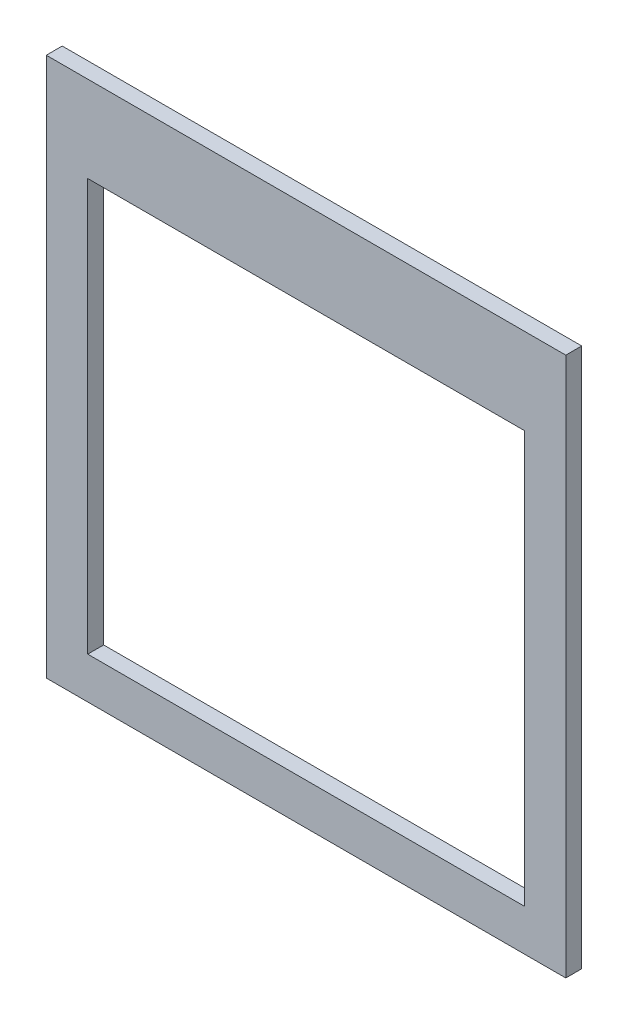
ISO-10303-21;
HEADER;
FILE_DESCRIPTION(('STEP AP214'),'2;1');
FILE_NAME('part.step','',(''),(''),'','','');
FILE_SCHEMA(('AUTOMOTIVE_DESIGN { 1 0 10303 214 1 1 1 1 }'));
ENDSEC;
DATA;
#1=APPLICATION_CONTEXT('core data for automotive mechanical design processes');
#2=APPLICATION_PROTOCOL_DEFINITION('international standard','automotive_design',2000,#1);
#3=PRODUCT_CONTEXT('',#1,'mechanical');
#4=PRODUCT('Part','Part','',(#3));
#5=PRODUCT_RELATED_PRODUCT_CATEGORY('part','',(#4));
#6=PRODUCT_DEFINITION_FORMATION('','',#4);
#7=PRODUCT_DEFINITION_CONTEXT('part definition',#1,'design');
#8=PRODUCT_DEFINITION('design','',#6,#7);
#9=PRODUCT_DEFINITION_SHAPE('','',#8);
#10=(LENGTH_UNIT() NAMED_UNIT(*) SI_UNIT(.MILLI.,.METRE.));
#11=(NAMED_UNIT(*) PLANE_ANGLE_UNIT() SI_UNIT($,.RADIAN.));
#12=(NAMED_UNIT(*) SI_UNIT($,.STERADIAN.) SOLID_ANGLE_UNIT());
#13=UNCERTAINTY_MEASURE_WITH_UNIT(LENGTH_MEASURE(1.E-05),#10,'distance_accuracy_value','');
#14=(GEOMETRIC_REPRESENTATION_CONTEXT(3) GLOBAL_UNCERTAINTY_ASSIGNED_CONTEXT((#13)) GLOBAL_UNIT_ASSIGNED_CONTEXT((#10,
#11,#12)) REPRESENTATION_CONTEXT('',''));
#15=CARTESIAN_POINT('',(0.,0.,0.));
#16=DIRECTION('',(0.,0.,1.));
#17=DIRECTION('',(1.,0.,0.));
#18=AXIS2_PLACEMENT_3D('',#15,#16,#17);
#19=CARTESIAN_POINT('',(0.,0.,10.));
#20=DIRECTION('',(0.,0.,1.));
#21=DIRECTION('',(1.,0.,0.));
#22=AXIS2_PLACEMENT_3D('',#19,#20,#21);
#23=PLANE('',#22);
#24=DIRECTION('',(0.,1.,0.));
#25=VECTOR('',#24,1.);
#26=CARTESIAN_POINT('',(303.228156891486,-332.131320016156,10.));
#27=LINE('',#26,#25);
#28=CARTESIAN_POINT('',(303.228156891486,-332.131320016156,10.));
#29=VERTEX_POINT('',#28);
#30=CARTESIAN_POINT('',(303.228156891486,6.36867998384431,10.));
#31=VERTEX_POINT('',#30);
#32=EDGE_CURVE('E136',#29,#31,#27,.T.);
#33=ORIENTED_EDGE('',*,*,#32,.T.);
#34=DIRECTION('',(-1.,0.,0.));
#35=VECTOR('',#34,1.);
#36=CARTESIAN_POINT('',(303.228156891486,6.36867998384431,10.));
#37=LINE('',#36,#35);
#38=CARTESIAN_POINT('',(-22.7718431085141,6.36867998384427,10.));
#39=VERTEX_POINT('',#38);
#40=EDGE_CURVE('E139',#31,#39,#37,.T.);
#41=ORIENTED_EDGE('',*,*,#40,.T.);
#42=DIRECTION('',(0.,-1.,0.));
#43=VECTOR('',#42,1.);
#44=CARTESIAN_POINT('',(-22.7718431085141,-332.131320016156,10.));
#45=LINE('',#44,#43);
#46=CARTESIAN_POINT('',(-22.7718431085141,-332.131320016156,10.));
#47=VERTEX_POINT('',#46);
#48=EDGE_CURVE('E142',#39,#47,#45,.T.);
#49=ORIENTED_EDGE('',*,*,#48,.T.);
#50=DIRECTION('',(1.,0.,0.));
#51=VECTOR('',#50,1.);
#52=CARTESIAN_POINT('',(303.228156891486,-332.131320016156,10.));
#53=LINE('',#52,#51);
#54=EDGE_CURVE('E144',#47,#29,#53,.T.);
#55=ORIENTED_EDGE('',*,*,#54,.T.);
#56=EDGE_LOOP('',(#33,#41,#49,#55));
#57=FACE_BOUND('',#56,.T.);
#58=DIRECTION('',(1.,0.,0.));
#59=VECTOR('',#58,1.);
#60=CARTESIAN_POINT('',(3.22815689148593,-306.131320016156,10.));
#61=LINE('',#60,#59);
#62=CARTESIAN_POINT('',(3.22815689148593,-306.131320016156,10.));
#63=VERTEX_POINT('',#62);
#64=CARTESIAN_POINT('',(277.228156891486,-306.131320016156,10.));
#65=VERTEX_POINT('',#64);
#66=EDGE_CURVE('E108',#63,#65,#61,.T.);
#67=ORIENTED_EDGE('',*,*,#66,.F.);
#68=DIRECTION('',(0.,-1.,0.));
#69=VECTOR('',#68,1.);
#70=CARTESIAN_POINT('',(3.2281568914859,-47.6313200161557,10.));
#71=LINE('',#70,#69);
#72=CARTESIAN_POINT('',(3.2281568914859,-47.6313200161557,10.));
#73=VERTEX_POINT('',#72);
#74=EDGE_CURVE('E100',#73,#63,#71,.T.);
#75=ORIENTED_EDGE('',*,*,#74,.F.);
#76=DIRECTION('',(-1.,0.,0.));
#77=VECTOR('',#76,1.);
#78=CARTESIAN_POINT('',(3.2281568914859,-47.6313200161557,10.));
#79=LINE('',#78,#77);
#80=CARTESIAN_POINT('',(277.228156891486,-47.6313200161557,10.));
#81=VERTEX_POINT('',#80);
#82=EDGE_CURVE('E122',#81,#73,#79,.T.);
#83=ORIENTED_EDGE('',*,*,#82,.F.);
#84=DIRECTION('',(0.,1.,0.));
#85=VECTOR('',#84,1.);
#86=CARTESIAN_POINT('',(277.228156891486,-47.6313200161557,10.));
#87=LINE('',#86,#85);
#88=EDGE_CURVE('E120',#65,#81,#87,.T.);
#89=ORIENTED_EDGE('',*,*,#88,.F.);
#90=EDGE_LOOP('',(#67,#75,#83,#89));
#91=FACE_BOUND('',#90,.T.);
#92=ADVANCED_FACE('F35',(#57,#91),#23,.T.);
#93=CARTESIAN_POINT('',(0.,0.,0.));
#94=DIRECTION('',(0.,0.,1.));
#95=DIRECTION('',(1.,0.,0.));
#96=AXIS2_PLACEMENT_3D('',#93,#94,#95);
#97=PLANE('',#96);
#98=DIRECTION('',(0.,1.,0.));
#99=VECTOR('',#98,1.);
#100=CARTESIAN_POINT('',(303.228156891486,-332.131320016156,0.));
#101=LINE('',#100,#99);
#102=CARTESIAN_POINT('',(303.228156891486,-332.131320016156,0.));
#103=VERTEX_POINT('',#102);
#104=CARTESIAN_POINT('',(303.228156891486,6.36867998384431,0.));
#105=VERTEX_POINT('',#104);
#106=EDGE_CURVE('E116',#103,#105,#101,.T.);
#107=ORIENTED_EDGE('',*,*,#106,.F.);
#108=DIRECTION('',(1.,0.,0.));
#109=VECTOR('',#108,1.);
#110=CARTESIAN_POINT('',(303.228156891486,-332.131320016156,0.));
#111=LINE('',#110,#109);
#112=CARTESIAN_POINT('',(-22.7718431085141,-332.131320016156,0.));
#113=VERTEX_POINT('',#112);
#114=EDGE_CURVE('E140',#113,#103,#111,.T.);
#115=ORIENTED_EDGE('',*,*,#114,.F.);
#116=DIRECTION('',(0.,-1.,0.));
#117=VECTOR('',#116,1.);
#118=CARTESIAN_POINT('',(-22.7718431085141,-332.131320016156,0.));
#119=LINE('',#118,#117);
#120=CARTESIAN_POINT('',(-22.7718431085141,6.36867998384427,0.));
#121=VERTEX_POINT('',#120);
#122=EDGE_CURVE('E151',#121,#113,#119,.T.);
#123=ORIENTED_EDGE('',*,*,#122,.F.);
#124=DIRECTION('',(-1.,0.,0.));
#125=VECTOR('',#124,1.);
#126=CARTESIAN_POINT('',(303.228156891486,6.36867998384431,0.));
#127=LINE('',#126,#125);
#128=EDGE_CURVE('E149',#105,#121,#127,.T.);
#129=ORIENTED_EDGE('',*,*,#128,.F.);
#130=EDGE_LOOP('',(#107,#115,#123,#129));
#131=FACE_BOUND('',#130,.T.);
#132=DIRECTION('',(0.,-1.,0.));
#133=VECTOR('',#132,1.);
#134=CARTESIAN_POINT('',(3.2281568914859,-47.6313200161557,0.));
#135=LINE('',#134,#133);
#136=CARTESIAN_POINT('',(3.2281568914859,-47.6313200161557,0.));
#137=VERTEX_POINT('',#136);
#138=CARTESIAN_POINT('',(3.22815689148593,-306.131320016156,0.));
#139=VERTEX_POINT('',#138);
#140=EDGE_CURVE('E58',#137,#139,#135,.T.);
#141=ORIENTED_EDGE('',*,*,#140,.T.);
#142=DIRECTION('',(1.,0.,0.));
#143=VECTOR('',#142,1.);
#144=CARTESIAN_POINT('',(3.22815689148593,-306.131320016156,0.));
#145=LINE('',#144,#143);
#146=CARTESIAN_POINT('',(277.228156891486,-306.131320016156,0.));
#147=VERTEX_POINT('',#146);
#148=EDGE_CURVE('E115',#139,#147,#145,.T.);
#149=ORIENTED_EDGE('',*,*,#148,.T.);
#150=DIRECTION('',(0.,1.,0.));
#151=VECTOR('',#150,1.);
#152=CARTESIAN_POINT('',(277.228156891486,-47.6313200161557,0.));
#153=LINE('',#152,#151);
#154=CARTESIAN_POINT('',(277.228156891486,-47.6313200161557,0.));
#155=VERTEX_POINT('',#154);
#156=EDGE_CURVE('E128',#147,#155,#153,.T.);
#157=ORIENTED_EDGE('',*,*,#156,.T.);
#158=DIRECTION('',(-1.,0.,0.));
#159=VECTOR('',#158,1.);
#160=CARTESIAN_POINT('',(3.2281568914859,-47.6313200161557,0.));
#161=LINE('',#160,#159);
#162=EDGE_CURVE('E109',#155,#137,#161,.T.);
#163=ORIENTED_EDGE('',*,*,#162,.T.);
#164=EDGE_LOOP('',(#141,#149,#157,#163));
#165=FACE_BOUND('',#164,.T.);
#166=ADVANCED_FACE('F169',(#131,#165),#97,.F.);
#167=CARTESIAN_POINT('',(303.228156891486,-332.131320016156,10.));
#168=DIRECTION('',(-1.,0.,0.));
#169=DIRECTION('',(0.,0.,1.));
#170=AXIS2_PLACEMENT_3D('',#167,#168,#169);
#171=PLANE('',#170);
#172=ORIENTED_EDGE('',*,*,#106,.T.);
#173=DIRECTION('',(0.,0.,-1.));
#174=VECTOR('',#173,1.);
#175=CARTESIAN_POINT('',(303.228156891486,6.36867998384431,10.));
#176=LINE('',#175,#174);
#177=EDGE_CURVE('E11',#31,#105,#176,.T.);
#178=ORIENTED_EDGE('',*,*,#177,.F.);
#179=ORIENTED_EDGE('',*,*,#32,.F.);
#180=DIRECTION('',(0.,0.,-1.));
#181=VECTOR('',#180,1.);
#182=CARTESIAN_POINT('',(303.228156891486,-332.131320016156,10.));
#183=LINE('',#182,#181);
#184=EDGE_CURVE('E146',#29,#103,#183,.T.);
#185=ORIENTED_EDGE('',*,*,#184,.T.);
#186=EDGE_LOOP('',(#172,#178,#179,#185));
#187=FACE_BOUND('',#186,.T.);
#188=ADVANCED_FACE('F37',(#187),#171,.F.);
#189=CARTESIAN_POINT('',(303.228156891486,6.36867998384431,10.));
#190=DIRECTION('',(0.,-1.,0.));
#191=DIRECTION('',(1.,0.,0.));
#192=AXIS2_PLACEMENT_3D('',#189,#190,#191);
#193=PLANE('',#192);
#194=ORIENTED_EDGE('',*,*,#128,.T.);
#195=DIRECTION('',(0.,0.,-1.));
#196=VECTOR('',#195,1.);
#197=CARTESIAN_POINT('',(-22.7718431085141,6.36867998384427,10.));
#198=LINE('',#197,#196);
#199=EDGE_CURVE('E43',#39,#121,#198,.T.);
#200=ORIENTED_EDGE('',*,*,#199,.F.);
#201=ORIENTED_EDGE('',*,*,#40,.F.);
#202=ORIENTED_EDGE('',*,*,#177,.T.);
#203=EDGE_LOOP('',(#194,#200,#201,#202));
#204=FACE_BOUND('',#203,.T.);
#205=ADVANCED_FACE('F179',(#204),#193,.F.);
#206=CARTESIAN_POINT('',(-22.7718431085141,-332.131320016156,10.));
#207=DIRECTION('',(1.,0.,0.));
#208=DIRECTION('',(0.,0.,-1.));
#209=AXIS2_PLACEMENT_3D('',#206,#207,#208);
#210=PLANE('',#209);
#211=ORIENTED_EDGE('',*,*,#122,.T.);
#212=DIRECTION('',(0.,0.,-1.));
#213=VECTOR('',#212,1.);
#214=CARTESIAN_POINT('',(-22.7718431085141,-332.131320016156,10.));
#215=LINE('',#214,#213);
#216=EDGE_CURVE('E156',#47,#113,#215,.T.);
#217=ORIENTED_EDGE('',*,*,#216,.F.);
#218=ORIENTED_EDGE('',*,*,#48,.F.);
#219=ORIENTED_EDGE('',*,*,#199,.T.);
#220=EDGE_LOOP('',(#211,#217,#218,#219));
#221=FACE_BOUND('',#220,.T.);
#222=ADVANCED_FACE('F163',(#221),#210,.F.);
#223=CARTESIAN_POINT('',(303.228156891486,-332.131320016156,10.));
#224=DIRECTION('',(0.,1.,0.));
#225=DIRECTION('',(-1.,0.,0.));
#226=AXIS2_PLACEMENT_3D('',#223,#224,#225);
#227=PLANE('',#226);
#228=ORIENTED_EDGE('',*,*,#114,.T.);
#229=ORIENTED_EDGE('',*,*,#184,.F.);
#230=ORIENTED_EDGE('',*,*,#54,.F.);
#231=ORIENTED_EDGE('',*,*,#216,.T.);
#232=EDGE_LOOP('',(#228,#229,#230,#231));
#233=FACE_BOUND('',#232,.T.);
#234=ADVANCED_FACE('F173',(#233),#227,.F.);
#235=CARTESIAN_POINT('',(3.2281568914859,-47.6313200161557,10.));
#236=DIRECTION('',(1.,0.,0.));
#237=DIRECTION('',(0.,1.,0.));
#238=AXIS2_PLACEMENT_3D('',#235,#236,#237);
#239=PLANE('',#238);
#240=ORIENTED_EDGE('',*,*,#140,.F.);
#241=DIRECTION('',(0.,0.,-1.));
#242=VECTOR('',#241,1.);
#243=CARTESIAN_POINT('',(3.2281568914859,-47.6313200161557,10.));
#244=LINE('',#243,#242);
#245=EDGE_CURVE('E104',#73,#137,#244,.T.);
#246=ORIENTED_EDGE('',*,*,#245,.F.);
#247=ORIENTED_EDGE('',*,*,#74,.T.);
#248=DIRECTION('',(0.,0.,-1.));
#249=VECTOR('',#248,1.);
#250=CARTESIAN_POINT('',(3.22815689148593,-306.131320016156,10.));
#251=LINE('',#250,#249);
#252=EDGE_CURVE('E103',#63,#139,#251,.T.);
#253=ORIENTED_EDGE('',*,*,#252,.T.);
#254=EDGE_LOOP('',(#240,#246,#247,#253));
#255=FACE_BOUND('',#254,.T.);
#256=ADVANCED_FACE('F102',(#255),#239,.T.);
#257=CARTESIAN_POINT('',(3.22815689148593,-306.131320016156,10.));
#258=DIRECTION('',(0.,1.,0.));
#259=DIRECTION('',(0.,0.,1.));
#260=AXIS2_PLACEMENT_3D('',#257,#258,#259);
#261=PLANE('',#260);
#262=ORIENTED_EDGE('',*,*,#148,.F.);
#263=ORIENTED_EDGE('',*,*,#252,.F.);
#264=ORIENTED_EDGE('',*,*,#66,.T.);
#265=DIRECTION('',(0.,0.,-1.));
#266=VECTOR('',#265,1.);
#267=CARTESIAN_POINT('',(277.228156891486,-306.131320016156,10.));
#268=LINE('',#267,#266);
#269=EDGE_CURVE('E117',#65,#147,#268,.T.);
#270=ORIENTED_EDGE('',*,*,#269,.T.);
#271=EDGE_LOOP('',(#262,#263,#264,#270));
#272=FACE_BOUND('',#271,.T.);
#273=ADVANCED_FACE('F112',(#272),#261,.T.);
#274=CARTESIAN_POINT('',(277.228156891486,-47.6313200161557,10.));
#275=DIRECTION('',(-1.,0.,0.));
#276=DIRECTION('',(0.,-1.,0.));
#277=AXIS2_PLACEMENT_3D('',#274,#275,#276);
#278=PLANE('',#277);
#279=ORIENTED_EDGE('',*,*,#156,.F.);
#280=ORIENTED_EDGE('',*,*,#269,.F.);
#281=ORIENTED_EDGE('',*,*,#88,.T.);
#282=DIRECTION('',(0.,0.,-1.));
#283=VECTOR('',#282,1.);
#284=CARTESIAN_POINT('',(277.228156891486,-47.6313200161557,10.));
#285=LINE('',#284,#283);
#286=EDGE_CURVE('E50',#81,#155,#285,.T.);
#287=ORIENTED_EDGE('',*,*,#286,.T.);
#288=EDGE_LOOP('',(#279,#280,#281,#287));
#289=FACE_BOUND('',#288,.T.);
#290=ADVANCED_FACE('F202',(#289),#278,.T.);
#291=CARTESIAN_POINT('',(3.2281568914859,-47.6313200161557,10.));
#292=DIRECTION('',(0.,-1.,0.));
#293=DIRECTION('',(1.,0.,0.));
#294=AXIS2_PLACEMENT_3D('',#291,#292,#293);
#295=PLANE('',#294);
#296=ORIENTED_EDGE('',*,*,#162,.F.);
#297=ORIENTED_EDGE('',*,*,#286,.F.);
#298=ORIENTED_EDGE('',*,*,#82,.T.);
#299=ORIENTED_EDGE('',*,*,#245,.T.);
#300=EDGE_LOOP('',(#296,#297,#298,#299));
#301=FACE_BOUND('',#300,.T.);
#302=ADVANCED_FACE('F206',(#301),#295,.T.);
#303=CLOSED_SHELL('',(#92,#166,#188,#205,#222,#234,#256,#273,#290,#302));
#304=MANIFOLD_SOLID_BREP('B2',#303);
#305=ADVANCED_BREP_SHAPE_REPRESENTATION('',(#18,#304),#14);
#306=SHAPE_DEFINITION_REPRESENTATION(#9,#305);
ENDSEC;
END-ISO-10303-21;
